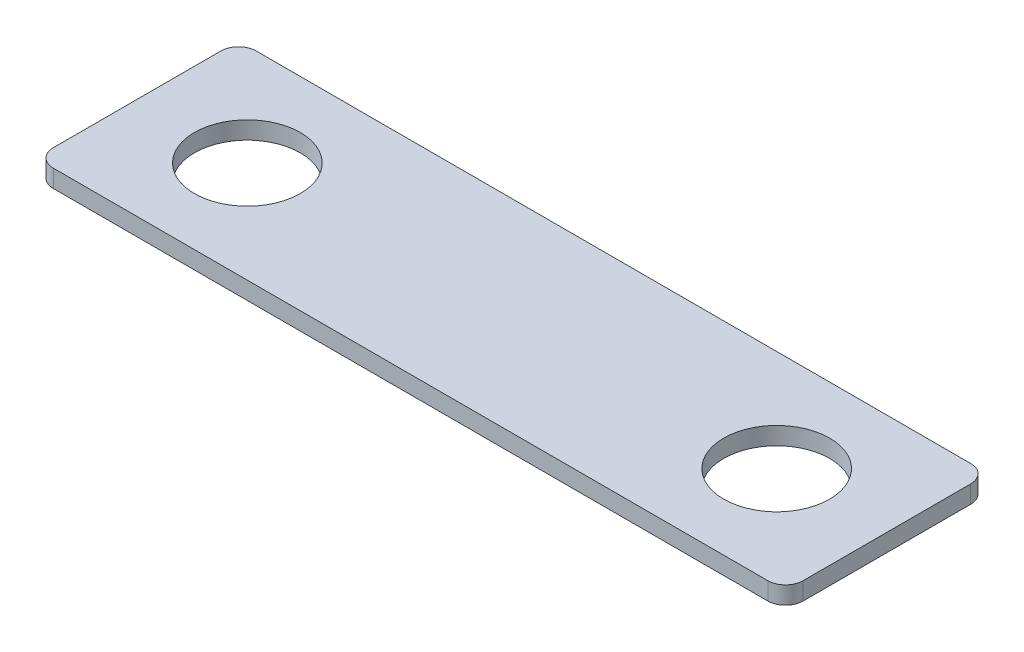
ISO-10303-21;
HEADER;
FILE_DESCRIPTION(('STEP AP214'),'2;1');
FILE_NAME('part.step','',(''),(''),'','','');
FILE_SCHEMA(('AUTOMOTIVE_DESIGN { 1 0 10303 214 1 1 1 1 }'));
ENDSEC;
DATA;
#1=APPLICATION_CONTEXT('core data for automotive mechanical design processes');
#2=APPLICATION_PROTOCOL_DEFINITION('international standard','automotive_design',2000,#1);
#3=PRODUCT_CONTEXT('',#1,'mechanical');
#4=PRODUCT('Part','Part','',(#3));
#5=PRODUCT_RELATED_PRODUCT_CATEGORY('part','',(#4));
#6=PRODUCT_DEFINITION_FORMATION('','',#4);
#7=PRODUCT_DEFINITION_CONTEXT('part definition',#1,'design');
#8=PRODUCT_DEFINITION('design','',#6,#7);
#9=PRODUCT_DEFINITION_SHAPE('','',#8);
#10=(LENGTH_UNIT() NAMED_UNIT(*) SI_UNIT(.MILLI.,.METRE.));
#11=(NAMED_UNIT(*) PLANE_ANGLE_UNIT() SI_UNIT($,.RADIAN.));
#12=(NAMED_UNIT(*) SI_UNIT($,.STERADIAN.) SOLID_ANGLE_UNIT());
#13=UNCERTAINTY_MEASURE_WITH_UNIT(LENGTH_MEASURE(1.E-05),#10,'distance_accuracy_value','');
#14=(GEOMETRIC_REPRESENTATION_CONTEXT(3) GLOBAL_UNCERTAINTY_ASSIGNED_CONTEXT((#13)) GLOBAL_UNIT_ASSIGNED_CONTEXT((#10,
#11,#12)) REPRESENTATION_CONTEXT('',''));
#15=CARTESIAN_POINT('',(0.,0.,0.));
#16=DIRECTION('',(0.,0.,1.));
#17=DIRECTION('',(1.,0.,0.));
#18=AXIS2_PLACEMENT_3D('',#15,#16,#17);
#19=CARTESIAN_POINT('',(40.5,2.,9.50000000000002));
#20=DIRECTION('',(0.,1.,0.));
#21=DIRECTION('',(0.,0.,1.));
#22=AXIS2_PLACEMENT_3D('',#19,#20,#21);
#23=PLANE('',#22);
#24=CARTESIAN_POINT('',(-30.,2.,0.));
#25=DIRECTION('',(0.,1.,0.));
#26=DIRECTION('',(0.,0.,-1.));
#27=AXIS2_PLACEMENT_3D('',#24,#25,#26);
#28=CIRCLE('',#27,6.);
#29=CARTESIAN_POINT('',(-30.,2.,-5.99999999999998));
#30=VERTEX_POINT('',#29);
#31=EDGE_CURVE('E146',#30,#30,#28,.T.);
#32=ORIENTED_EDGE('',*,*,#31,.F.);
#33=EDGE_LOOP('',(#32));
#34=FACE_BOUND('',#33,.T.);
#35=CARTESIAN_POINT('',(40.5,2.,9.50000000000002));
#36=DIRECTION('',(0.,1.,0.));
#37=DIRECTION('',(0.,0.,1.));
#38=AXIS2_PLACEMENT_3D('',#35,#36,#37);
#39=CIRCLE('',#38,2.);
#40=CARTESIAN_POINT('',(40.5,2.,11.5));
#41=VERTEX_POINT('',#40);
#42=CARTESIAN_POINT('',(42.5,2.,9.50000000000002));
#43=VERTEX_POINT('',#42);
#44=EDGE_CURVE('E164',#41,#43,#39,.T.);
#45=ORIENTED_EDGE('',*,*,#44,.T.);
#46=DIRECTION('',(0.,0.,-1.));
#47=VECTOR('',#46,1.);
#48=CARTESIAN_POINT('',(42.5,2.,9.50000000000002));
#49=LINE('',#48,#47);
#50=CARTESIAN_POINT('',(42.5,2.,-9.49999999999998));
#51=VERTEX_POINT('',#50);
#52=EDGE_CURVE('E100',#43,#51,#49,.T.);
#53=ORIENTED_EDGE('',*,*,#52,.T.);
#54=CARTESIAN_POINT('',(40.5,2.,-9.49999999999998));
#55=DIRECTION('',(0.,1.,0.));
#56=DIRECTION('',(0.,0.,1.));
#57=AXIS2_PLACEMENT_3D('',#54,#55,#56);
#58=CIRCLE('',#57,2.);
#59=CARTESIAN_POINT('',(40.5,2.,-11.5));
#60=VERTEX_POINT('',#59);
#61=EDGE_CURVE('E185',#51,#60,#58,.T.);
#62=ORIENTED_EDGE('',*,*,#61,.T.);
#63=DIRECTION('',(-1.,0.,0.));
#64=VECTOR('',#63,1.);
#65=CARTESIAN_POINT('',(40.5,2.,-11.5));
#66=LINE('',#65,#64);
#67=CARTESIAN_POINT('',(-40.5,2.,-11.5));
#68=VERTEX_POINT('',#67);
#69=EDGE_CURVE('E199',#60,#68,#66,.T.);
#70=ORIENTED_EDGE('',*,*,#69,.T.);
#71=CARTESIAN_POINT('',(-40.5,2.,-9.49999999999998));
#72=DIRECTION('',(0.,1.,0.));
#73=DIRECTION('',(0.,0.,1.));
#74=AXIS2_PLACEMENT_3D('',#71,#72,#73);
#75=CIRCLE('',#74,2.);
#76=CARTESIAN_POINT('',(-42.5,2.,-9.49999999999998));
#77=VERTEX_POINT('',#76);
#78=EDGE_CURVE('E119',#68,#77,#75,.T.);
#79=ORIENTED_EDGE('',*,*,#78,.T.);
#80=DIRECTION('',(0.,0.,1.));
#81=VECTOR('',#80,1.);
#82=CARTESIAN_POINT('',(-42.5,2.,9.50000000000002));
#83=LINE('',#82,#81);
#84=CARTESIAN_POINT('',(-42.5,2.,9.50000000000002));
#85=VERTEX_POINT('',#84);
#86=EDGE_CURVE('E113',#77,#85,#83,.T.);
#87=ORIENTED_EDGE('',*,*,#86,.T.);
#88=CARTESIAN_POINT('',(-40.5,2.,9.50000000000002));
#89=DIRECTION('',(0.,1.,0.));
#90=DIRECTION('',(0.,0.,-1.));
#91=AXIS2_PLACEMENT_3D('',#88,#89,#90);
#92=CIRCLE('',#91,2.);
#93=CARTESIAN_POINT('',(-40.5,2.,11.5));
#94=VERTEX_POINT('',#93);
#95=EDGE_CURVE('E117',#85,#94,#92,.T.);
#96=ORIENTED_EDGE('',*,*,#95,.T.);
#97=DIRECTION('',(1.,0.,0.));
#98=VECTOR('',#97,1.);
#99=CARTESIAN_POINT('',(40.5,2.,11.5));
#100=LINE('',#99,#98);
#101=EDGE_CURVE('E57',#94,#41,#100,.T.);
#102=ORIENTED_EDGE('',*,*,#101,.T.);
#103=EDGE_LOOP('',(#45,#53,#62,#70,#79,#87,#96,#102));
#104=FACE_BOUND('',#103,.T.);
#105=CARTESIAN_POINT('',(30.,2.,0.));
#106=DIRECTION('',(0.,1.,0.));
#107=DIRECTION('',(0.,0.,1.));
#108=AXIS2_PLACEMENT_3D('',#105,#106,#107);
#109=CIRCLE('',#108,6.);
#110=CARTESIAN_POINT('',(30.,2.,6.00000000000002));
#111=VERTEX_POINT('',#110);
#112=EDGE_CURVE('E213',#111,#111,#109,.T.);
#113=ORIENTED_EDGE('',*,*,#112,.F.);
#114=EDGE_LOOP('',(#113));
#115=FACE_BOUND('',#114,.T.);
#116=ADVANCED_FACE('F39',(#34,#104,#115),#23,.T.);
#117=CARTESIAN_POINT('',(40.5,0.,9.50000000000002));
#118=DIRECTION('',(0.,1.,0.));
#119=DIRECTION('',(0.,0.,1.));
#120=AXIS2_PLACEMENT_3D('',#117,#118,#119);
#121=PLANE('',#120);
#122=CARTESIAN_POINT('',(40.5,0.,9.50000000000002));
#123=DIRECTION('',(0.,1.,0.));
#124=DIRECTION('',(0.,0.,1.));
#125=AXIS2_PLACEMENT_3D('',#122,#123,#124);
#126=CIRCLE('',#125,2.);
#127=CARTESIAN_POINT('',(40.5,0.,11.5));
#128=VERTEX_POINT('',#127);
#129=CARTESIAN_POINT('',(42.5,0.,9.50000000000002));
#130=VERTEX_POINT('',#129);
#131=EDGE_CURVE('E141',#128,#130,#126,.T.);
#132=ORIENTED_EDGE('',*,*,#131,.F.);
#133=DIRECTION('',(1.,0.,0.));
#134=VECTOR('',#133,1.);
#135=CARTESIAN_POINT('',(40.5,0.,11.5));
#136=LINE('',#135,#134);
#137=CARTESIAN_POINT('',(-40.5,0.,11.5));
#138=VERTEX_POINT('',#137);
#139=EDGE_CURVE('E92',#138,#128,#136,.T.);
#140=ORIENTED_EDGE('',*,*,#139,.F.);
#141=CARTESIAN_POINT('',(-40.5,0.,9.50000000000002));
#142=DIRECTION('',(0.,1.,0.));
#143=DIRECTION('',(0.,0.,-1.));
#144=AXIS2_PLACEMENT_3D('',#141,#142,#143);
#145=CIRCLE('',#144,2.);
#146=CARTESIAN_POINT('',(-42.5,0.,9.50000000000002));
#147=VERTEX_POINT('',#146);
#148=EDGE_CURVE('E86',#147,#138,#145,.T.);
#149=ORIENTED_EDGE('',*,*,#148,.F.);
#150=DIRECTION('',(0.,0.,1.));
#151=VECTOR('',#150,1.);
#152=CARTESIAN_POINT('',(-42.5,0.,9.50000000000002));
#153=LINE('',#152,#151);
#154=CARTESIAN_POINT('',(-42.5,0.,-9.49999999999998));
#155=VERTEX_POINT('',#154);
#156=EDGE_CURVE('E128',#155,#147,#153,.T.);
#157=ORIENTED_EDGE('',*,*,#156,.F.);
#158=CARTESIAN_POINT('',(-40.5,0.,-9.49999999999998));
#159=DIRECTION('',(0.,1.,0.));
#160=DIRECTION('',(0.,0.,1.));
#161=AXIS2_PLACEMENT_3D('',#158,#159,#160);
#162=CIRCLE('',#161,2.);
#163=CARTESIAN_POINT('',(-40.5,0.,-11.5));
#164=VERTEX_POINT('',#163);
#165=EDGE_CURVE('E155',#164,#155,#162,.T.);
#166=ORIENTED_EDGE('',*,*,#165,.F.);
#167=DIRECTION('',(-1.,0.,0.));
#168=VECTOR('',#167,1.);
#169=CARTESIAN_POINT('',(40.5,0.,-11.5));
#170=LINE('',#169,#168);
#171=CARTESIAN_POINT('',(40.5,0.,-11.5));
#172=VERTEX_POINT('',#171);
#173=EDGE_CURVE('E152',#172,#164,#170,.T.);
#174=ORIENTED_EDGE('',*,*,#173,.F.);
#175=CARTESIAN_POINT('',(40.5,0.,-9.49999999999998));
#176=DIRECTION('',(0.,1.,0.));
#177=DIRECTION('',(0.,0.,1.));
#178=AXIS2_PLACEMENT_3D('',#175,#176,#177);
#179=CIRCLE('',#178,2.);
#180=CARTESIAN_POINT('',(42.5,0.,-9.49999999999998));
#181=VERTEX_POINT('',#180);
#182=EDGE_CURVE('E149',#181,#172,#179,.T.);
#183=ORIENTED_EDGE('',*,*,#182,.F.);
#184=DIRECTION('',(0.,0.,-1.));
#185=VECTOR('',#184,1.);
#186=CARTESIAN_POINT('',(42.5,0.,9.50000000000002));
#187=LINE('',#186,#185);
#188=EDGE_CURVE('E145',#130,#181,#187,.T.);
#189=ORIENTED_EDGE('',*,*,#188,.F.);
#190=EDGE_LOOP('',(#132,#140,#149,#157,#166,#174,#183,#189));
#191=FACE_BOUND('',#190,.T.);
#192=CARTESIAN_POINT('',(-30.,0.,0.));
#193=DIRECTION('',(0.,1.,0.));
#194=DIRECTION('',(0.,0.,1.));
#195=AXIS2_PLACEMENT_3D('',#192,#193,#194);
#196=CIRCLE('',#195,6.);
#197=CARTESIAN_POINT('',(-30.,0.,6.00000000000002));
#198=VERTEX_POINT('',#197);
#199=EDGE_CURVE('E209',#198,#198,#196,.T.);
#200=ORIENTED_EDGE('',*,*,#199,.T.);
#201=EDGE_LOOP('',(#200));
#202=FACE_BOUND('',#201,.T.);
#203=CARTESIAN_POINT('',(30.,0.,0.));
#204=DIRECTION('',(0.,1.,0.));
#205=DIRECTION('',(0.,0.,-1.));
#206=AXIS2_PLACEMENT_3D('',#203,#204,#205);
#207=CIRCLE('',#206,6.);
#208=CARTESIAN_POINT('',(30.,0.,-5.99999999999998));
#209=VERTEX_POINT('',#208);
#210=EDGE_CURVE('E217',#209,#209,#207,.T.);
#211=ORIENTED_EDGE('',*,*,#210,.T.);
#212=EDGE_LOOP('',(#211));
#213=FACE_BOUND('',#212,.T.);
#214=ADVANCED_FACE('F189',(#191,#202,#213),#121,.F.);
#215=CARTESIAN_POINT('',(40.5,2.,9.50000000000002));
#216=DIRECTION('',(0.,-1.,0.));
#217=DIRECTION('',(0.,0.,-1.));
#218=AXIS2_PLACEMENT_3D('',#215,#216,#217);
#219=CYLINDRICAL_SURFACE('',#218,2.);
#220=ORIENTED_EDGE('',*,*,#131,.T.);
#221=DIRECTION('',(0.,-1.,0.));
#222=VECTOR('',#221,1.);
#223=CARTESIAN_POINT('',(42.5,2.,9.50000000000002));
#224=LINE('',#223,#222);
#225=EDGE_CURVE('E11',#43,#130,#224,.T.);
#226=ORIENTED_EDGE('',*,*,#225,.F.);
#227=ORIENTED_EDGE('',*,*,#44,.F.);
#228=DIRECTION('',(0.,-1.,0.));
#229=VECTOR('',#228,1.);
#230=CARTESIAN_POINT('',(40.5,2.,11.5));
#231=LINE('',#230,#229);
#232=EDGE_CURVE('E137',#41,#128,#231,.T.);
#233=ORIENTED_EDGE('',*,*,#232,.T.);
#234=EDGE_LOOP('',(#220,#226,#227,#233));
#235=FACE_BOUND('',#234,.T.);
#236=ADVANCED_FACE('F41',(#235),#219,.T.);
#237=CARTESIAN_POINT('',(42.5,2.,9.50000000000002));
#238=DIRECTION('',(-1.,0.,0.));
#239=DIRECTION('',(0.,0.,1.));
#240=AXIS2_PLACEMENT_3D('',#237,#238,#239);
#241=PLANE('',#240);
#242=ORIENTED_EDGE('',*,*,#188,.T.);
#243=DIRECTION('',(0.,-1.,0.));
#244=VECTOR('',#243,1.);
#245=CARTESIAN_POINT('',(42.5,2.,-9.49999999999998));
#246=LINE('',#245,#244);
#247=EDGE_CURVE('E49',#51,#181,#246,.T.);
#248=ORIENTED_EDGE('',*,*,#247,.F.);
#249=ORIENTED_EDGE('',*,*,#52,.F.);
#250=ORIENTED_EDGE('',*,*,#225,.T.);
#251=EDGE_LOOP('',(#242,#248,#249,#250));
#252=FACE_BOUND('',#251,.T.);
#253=ADVANCED_FACE('F250',(#252),#241,.F.);
#254=CARTESIAN_POINT('',(40.5,2.,-9.49999999999998));
#255=DIRECTION('',(0.,-1.,0.));
#256=DIRECTION('',(0.,0.,-1.));
#257=AXIS2_PLACEMENT_3D('',#254,#255,#256);
#258=CYLINDRICAL_SURFACE('',#257,2.);
#259=ORIENTED_EDGE('',*,*,#182,.T.);
#260=DIRECTION('',(0.,-1.,0.));
#261=VECTOR('',#260,1.);
#262=CARTESIAN_POINT('',(40.5,2.,-11.5));
#263=LINE('',#262,#261);
#264=EDGE_CURVE('E175',#60,#172,#263,.T.);
#265=ORIENTED_EDGE('',*,*,#264,.F.);
#266=ORIENTED_EDGE('',*,*,#61,.F.);
#267=ORIENTED_EDGE('',*,*,#247,.T.);
#268=EDGE_LOOP('',(#259,#265,#266,#267));
#269=FACE_BOUND('',#268,.T.);
#270=ADVANCED_FACE('F183',(#269),#258,.T.);
#271=CARTESIAN_POINT('',(40.5,2.,-11.5));
#272=DIRECTION('',(0.,0.,1.));
#273=DIRECTION('',(1.,0.,0.));
#274=AXIS2_PLACEMENT_3D('',#271,#272,#273);
#275=PLANE('',#274);
#276=ORIENTED_EDGE('',*,*,#173,.T.);
#277=DIRECTION('',(0.,-1.,0.));
#278=VECTOR('',#277,1.);
#279=CARTESIAN_POINT('',(-40.5,2.,-11.5));
#280=LINE('',#279,#278);
#281=EDGE_CURVE('E171',#68,#164,#280,.T.);
#282=ORIENTED_EDGE('',*,*,#281,.F.);
#283=ORIENTED_EDGE('',*,*,#69,.F.);
#284=ORIENTED_EDGE('',*,*,#264,.T.);
#285=EDGE_LOOP('',(#276,#282,#283,#284));
#286=FACE_BOUND('',#285,.T.);
#287=ADVANCED_FACE('F194',(#286),#275,.F.);
#288=CARTESIAN_POINT('',(-40.5,2.,-9.49999999999998));
#289=DIRECTION('',(0.,-1.,0.));
#290=DIRECTION('',(0.,0.,-1.));
#291=AXIS2_PLACEMENT_3D('',#288,#289,#290);
#292=CYLINDRICAL_SURFACE('',#291,2.);
#293=ORIENTED_EDGE('',*,*,#165,.T.);
#294=DIRECTION('',(0.,-1.,0.));
#295=VECTOR('',#294,1.);
#296=CARTESIAN_POINT('',(-42.5,2.,-9.49999999999998));
#297=LINE('',#296,#295);
#298=EDGE_CURVE('E130',#77,#155,#297,.T.);
#299=ORIENTED_EDGE('',*,*,#298,.F.);
#300=ORIENTED_EDGE('',*,*,#78,.F.);
#301=ORIENTED_EDGE('',*,*,#281,.T.);
#302=EDGE_LOOP('',(#293,#299,#300,#301));
#303=FACE_BOUND('',#302,.T.);
#304=ADVANCED_FACE('F197',(#303),#292,.T.);
#305=CARTESIAN_POINT('',(-42.5,2.,9.50000000000002));
#306=DIRECTION('',(1.,0.,0.));
#307=DIRECTION('',(0.,0.,-1.));
#308=AXIS2_PLACEMENT_3D('',#305,#306,#307);
#309=PLANE('',#308);
#310=ORIENTED_EDGE('',*,*,#156,.T.);
#311=DIRECTION('',(0.,-1.,0.));
#312=VECTOR('',#311,1.);
#313=CARTESIAN_POINT('',(-42.5,2.,9.50000000000002));
#314=LINE('',#313,#312);
#315=EDGE_CURVE('E125',#85,#147,#314,.T.);
#316=ORIENTED_EDGE('',*,*,#315,.F.);
#317=ORIENTED_EDGE('',*,*,#86,.F.);
#318=ORIENTED_EDGE('',*,*,#298,.T.);
#319=EDGE_LOOP('',(#310,#316,#317,#318));
#320=FACE_BOUND('',#319,.T.);
#321=ADVANCED_FACE('F126',(#320),#309,.F.);
#322=CARTESIAN_POINT('',(-40.5,2.,9.50000000000002));
#323=DIRECTION('',(0.,-1.,0.));
#324=DIRECTION('',(0.,0.,-1.));
#325=AXIS2_PLACEMENT_3D('',#322,#323,#324);
#326=CYLINDRICAL_SURFACE('',#325,2.);
#327=ORIENTED_EDGE('',*,*,#148,.T.);
#328=DIRECTION('',(0.,-1.,0.));
#329=VECTOR('',#328,1.);
#330=CARTESIAN_POINT('',(-40.5,2.,11.5));
#331=LINE('',#330,#329);
#332=EDGE_CURVE('E131',#94,#138,#331,.T.);
#333=ORIENTED_EDGE('',*,*,#332,.F.);
#334=ORIENTED_EDGE('',*,*,#95,.F.);
#335=ORIENTED_EDGE('',*,*,#315,.T.);
#336=EDGE_LOOP('',(#327,#333,#334,#335));
#337=FACE_BOUND('',#336,.T.);
#338=ADVANCED_FACE('F133',(#337),#326,.T.);
#339=CARTESIAN_POINT('',(40.5,2.,11.5));
#340=DIRECTION('',(0.,0.,-1.));
#341=DIRECTION('',(-1.,0.,0.));
#342=AXIS2_PLACEMENT_3D('',#339,#340,#341);
#343=PLANE('',#342);
#344=ORIENTED_EDGE('',*,*,#139,.T.);
#345=ORIENTED_EDGE('',*,*,#232,.F.);
#346=ORIENTED_EDGE('',*,*,#101,.F.);
#347=ORIENTED_EDGE('',*,*,#332,.T.);
#348=EDGE_LOOP('',(#344,#345,#346,#347));
#349=FACE_BOUND('',#348,.T.);
#350=ADVANCED_FACE('F238',(#349),#343,.F.);
#351=CARTESIAN_POINT('',(-30.,2.,0.));
#352=DIRECTION('',(0.,-1.,0.));
#353=DIRECTION('',(0.,0.,-1.));
#354=AXIS2_PLACEMENT_3D('',#351,#352,#353);
#355=CYLINDRICAL_SURFACE('',#354,6.);
#356=ORIENTED_EDGE('',*,*,#199,.F.);
#357=EDGE_LOOP('',(#356));
#358=FACE_BOUND('',#357,.T.);
#359=ORIENTED_EDGE('',*,*,#31,.T.);
#360=EDGE_LOOP('',(#359));
#361=FACE_BOUND('',#360,.T.);
#362=ADVANCED_FACE('F235',(#358,#361),#355,.F.);
#363=CARTESIAN_POINT('',(30.,2.,0.));
#364=DIRECTION('',(0.,-1.,0.));
#365=DIRECTION('',(0.,0.,-1.));
#366=AXIS2_PLACEMENT_3D('',#363,#364,#365);
#367=CYLINDRICAL_SURFACE('',#366,6.);
#368=ORIENTED_EDGE('',*,*,#210,.F.);
#369=EDGE_LOOP('',(#368));
#370=FACE_BOUND('',#369,.T.);
#371=ORIENTED_EDGE('',*,*,#112,.T.);
#372=EDGE_LOOP('',(#371));
#373=FACE_BOUND('',#372,.T.);
#374=ADVANCED_FACE('F225',(#370,#373),#367,.F.);
#375=CLOSED_SHELL('',(#116,#214,#236,#253,#270,#287,#304,#321,#338,#350,#362,#374));
#376=MANIFOLD_SOLID_BREP('B2',#375);
#377=ADVANCED_BREP_SHAPE_REPRESENTATION('',(#18,#376),#14);
#378=SHAPE_DEFINITION_REPRESENTATION(#9,#377);
ENDSEC;
END-ISO-10303-21;
